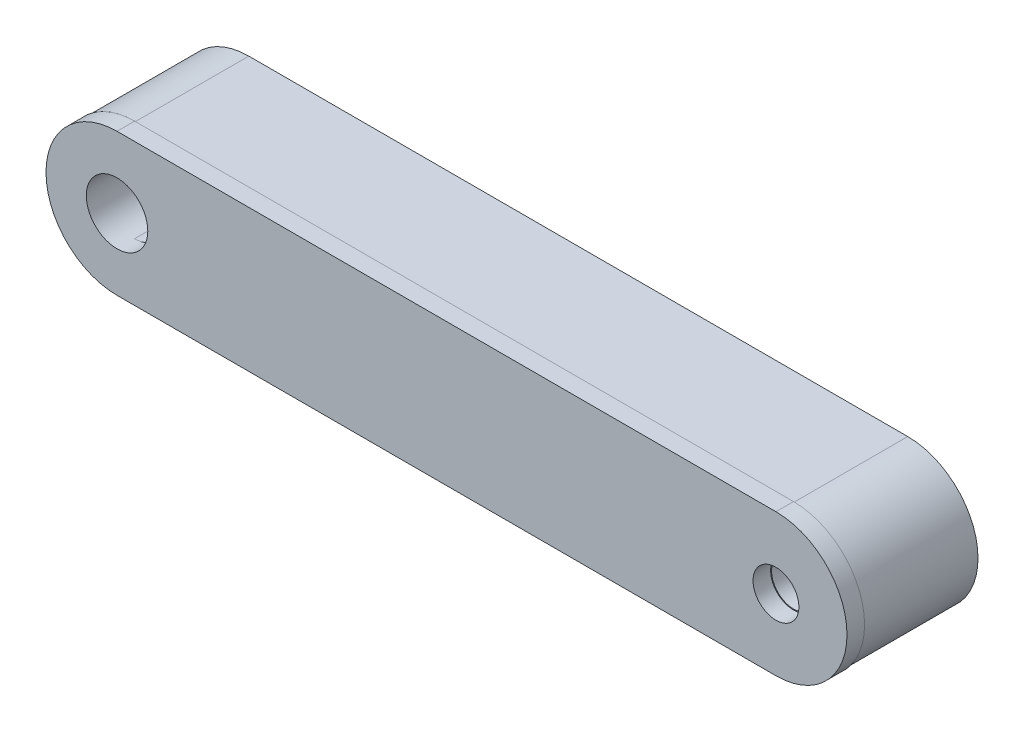
ISO-10303-21;
HEADER;
FILE_DESCRIPTION(('STEP AP214'),'2;1');
FILE_NAME('part.step','',(''),(''),'','','');
FILE_SCHEMA(('AUTOMOTIVE_DESIGN { 1 0 10303 214 1 1 1 1 }'));
ENDSEC;
DATA;
#1=APPLICATION_CONTEXT('core data for automotive mechanical design processes');
#2=APPLICATION_PROTOCOL_DEFINITION('international standard','automotive_design',2000,#1);
#3=PRODUCT_CONTEXT('',#1,'mechanical');
#4=PRODUCT('Part','Part','',(#3));
#5=PRODUCT_RELATED_PRODUCT_CATEGORY('part','',(#4));
#6=PRODUCT_DEFINITION_FORMATION('','',#4);
#7=PRODUCT_DEFINITION_CONTEXT('part definition',#1,'design');
#8=PRODUCT_DEFINITION('design','',#6,#7);
#9=PRODUCT_DEFINITION_SHAPE('','',#8);
#10=(LENGTH_UNIT() NAMED_UNIT(*) SI_UNIT(.MILLI.,.METRE.));
#11=(NAMED_UNIT(*) PLANE_ANGLE_UNIT() SI_UNIT($,.RADIAN.));
#12=(NAMED_UNIT(*) SI_UNIT($,.STERADIAN.) SOLID_ANGLE_UNIT());
#13=UNCERTAINTY_MEASURE_WITH_UNIT(LENGTH_MEASURE(1.E-05),#10,'distance_accuracy_value','');
#14=(GEOMETRIC_REPRESENTATION_CONTEXT(3) GLOBAL_UNCERTAINTY_ASSIGNED_CONTEXT((#13)) GLOBAL_UNIT_ASSIGNED_CONTEXT((#10,
#11,#12)) REPRESENTATION_CONTEXT('',''));
#15=CARTESIAN_POINT('',(0.,0.,0.));
#16=DIRECTION('',(0.,0.,1.));
#17=DIRECTION('',(1.,0.,0.));
#18=AXIS2_PLACEMENT_3D('',#15,#16,#17);
#19=CARTESIAN_POINT('',(-89.7682873370258,37.3359599747915,13.));
#20=DIRECTION('',(0.,0.,1.));
#21=DIRECTION('',(1.,0.,0.));
#22=AXIS2_PLACEMENT_3D('',#19,#20,#21);
#23=PLANE('',#22);
#24=CARTESIAN_POINT('',(-14.7682873370258,37.3359599747915,13.));
#25=DIRECTION('',(0.,0.,1.));
#26=DIRECTION('',(1.,0.,0.));
#27=AXIS2_PLACEMENT_3D('',#24,#25,#26);
#28=CIRCLE('',#27,2.5);
#29=CARTESIAN_POINT('',(-12.2682873370258,37.3359599747915,13.));
#30=VERTEX_POINT('',#29);
#31=EDGE_CURVE('E190',#30,#30,#28,.T.);
#32=ORIENTED_EDGE('',*,*,#31,.F.);
#33=EDGE_LOOP('',(#32));
#34=FACE_BOUND('',#33,.T.);
#35=CARTESIAN_POINT('',(-14.7682873370258,37.3359599747915,13.));
#36=DIRECTION('',(0.,0.,1.));
#37=DIRECTION('',(1.,0.,0.));
#38=AXIS2_PLACEMENT_3D('',#35,#36,#37);
#39=CIRCLE('',#38,2.60991752517465);
#40=CARTESIAN_POINT('',(-12.1583698118512,37.3359599747915,13.));
#41=VERTEX_POINT('',#40);
#42=EDGE_CURVE('E334',#41,#41,#39,.T.);
#43=ORIENTED_EDGE('',*,*,#42,.T.);
#44=EDGE_LOOP('',(#43));
#45=FACE_BOUND('',#44,.T.);
#46=ADVANCED_FACE('F34',(#34,#45),#23,.T.);
#47=CARTESIAN_POINT('',(-89.7682873370258,37.3359599747915,0.));
#48=DIRECTION('',(0.,0.,1.));
#49=DIRECTION('',(1.,0.,0.));
#50=AXIS2_PLACEMENT_3D('',#47,#48,#49);
#51=PLANE('',#50);
#52=CARTESIAN_POINT('',(-14.7682873370258,37.3359599747915,0.));
#53=DIRECTION('',(0.,0.,1.));
#54=DIRECTION('',(1.,0.,0.));
#55=AXIS2_PLACEMENT_3D('',#52,#53,#54);
#56=CIRCLE('',#55,2.5);
#57=CARTESIAN_POINT('',(-12.2682873370258,37.3359599747915,0.));
#58=VERTEX_POINT('',#57);
#59=EDGE_CURVE('E194',#58,#58,#56,.T.);
#60=ORIENTED_EDGE('',*,*,#59,.T.);
#61=EDGE_LOOP('',(#60));
#62=FACE_BOUND('',#61,.T.);
#63=CARTESIAN_POINT('',(-89.7682873370258,37.3359599747915,0.));
#64=DIRECTION('',(0.,0.,1.));
#65=DIRECTION('',(1.,0.,0.));
#66=AXIS2_PLACEMENT_3D('',#63,#64,#65);
#67=CIRCLE('',#66,7.99754796356378);
#68=CARTESIAN_POINT('',(-89.7682873370258,45.3335079383553,0.));
#69=VERTEX_POINT('',#68);
#70=CARTESIAN_POINT('',(-89.7682873370258,29.3384120112277,0.));
#71=VERTEX_POINT('',#70);
#72=EDGE_CURVE('E193',#69,#71,#67,.T.);
#73=ORIENTED_EDGE('',*,*,#72,.F.);
#74=DIRECTION('',(-1.,0.,0.));
#75=VECTOR('',#74,1.);
#76=CARTESIAN_POINT('',(-89.7682873370258,45.3335079383553,0.));
#77=LINE('',#76,#75);
#78=CARTESIAN_POINT('',(-14.7682873370258,45.3335079383553,0.));
#79=VERTEX_POINT('',#78);
#80=EDGE_CURVE('E201',#79,#69,#77,.T.);
#81=ORIENTED_EDGE('',*,*,#80,.F.);
#82=CARTESIAN_POINT('',(-14.7682873370258,37.3359599747915,0.));
#83=DIRECTION('',(0.,0.,1.));
#84=DIRECTION('',(1.,0.,0.));
#85=AXIS2_PLACEMENT_3D('',#82,#83,#84);
#86=CIRCLE('',#85,7.99754796356378);
#87=CARTESIAN_POINT('',(-14.7682873370258,29.3384120112278,0.));
#88=VERTEX_POINT('',#87);
#89=EDGE_CURVE('E215',#88,#79,#86,.T.);
#90=ORIENTED_EDGE('',*,*,#89,.F.);
#91=DIRECTION('',(1.,0.,0.));
#92=VECTOR('',#91,1.);
#93=CARTESIAN_POINT('',(-89.7682873370258,29.3384120112277,0.));
#94=LINE('',#93,#92);
#95=EDGE_CURVE('E213',#71,#88,#94,.T.);
#96=ORIENTED_EDGE('',*,*,#95,.F.);
#97=EDGE_LOOP('',(#73,#81,#90,#96));
#98=FACE_BOUND('',#97,.T.);
#99=CARTESIAN_POINT('',(-89.7682873370258,37.3359599747915,0.));
#100=DIRECTION('',(0.,0.,1.));
#101=DIRECTION('',(1.,0.,0.));
#102=AXIS2_PLACEMENT_3D('',#99,#100,#101);
#103=CIRCLE('',#102,3.50000000000001);
#104=CARTESIAN_POINT('',(-89.7682873370258,40.8359599747915,0.));
#105=VERTEX_POINT('',#104);
#106=CARTESIAN_POINT('',(-89.7682873370258,33.8359599747915,0.));
#107=VERTEX_POINT('',#106);
#108=EDGE_CURVE('E59',#105,#107,#103,.T.);
#109=ORIENTED_EDGE('',*,*,#108,.T.);
#110=DIRECTION('',(1.,0.,0.));
#111=VECTOR('',#110,1.);
#112=CARTESIAN_POINT('',(-89.7682873370258,33.8359599747915,0.));
#113=LINE('',#112,#111);
#114=CARTESIAN_POINT('',(-77.7682873370258,33.8359599747915,0.));
#115=VERTEX_POINT('',#114);
#116=EDGE_CURVE('E154',#107,#115,#113,.T.);
#117=ORIENTED_EDGE('',*,*,#116,.T.);
#118=CARTESIAN_POINT('',(-77.7682873370258,37.3359599747915,0.));
#119=DIRECTION('',(0.,0.,1.));
#120=DIRECTION('',(-1.,0.,0.));
#121=AXIS2_PLACEMENT_3D('',#118,#119,#120);
#122=CIRCLE('',#121,3.50000000000001);
#123=CARTESIAN_POINT('',(-77.7682873370258,40.8359599747915,0.));
#124=VERTEX_POINT('',#123);
#125=EDGE_CURVE('E237',#115,#124,#122,.T.);
#126=ORIENTED_EDGE('',*,*,#125,.T.);
#127=DIRECTION('',(-1.,0.,0.));
#128=VECTOR('',#127,1.);
#129=CARTESIAN_POINT('',(-89.7682873370258,40.8359599747915,0.));
#130=LINE('',#129,#128);
#131=EDGE_CURVE('E187',#124,#105,#130,.T.);
#132=ORIENTED_EDGE('',*,*,#131,.T.);
#133=EDGE_LOOP('',(#109,#117,#126,#132));
#134=FACE_BOUND('',#133,.T.);
#135=ADVANCED_FACE('F235',(#62,#98,#134),#51,.F.);
#136=CARTESIAN_POINT('',(-89.7682873370258,37.3359599747915,13.));
#137=DIRECTION('',(0.,0.,-1.));
#138=DIRECTION('',(-1.,0.,0.));
#139=AXIS2_PLACEMENT_3D('',#136,#137,#138);
#140=CYLINDRICAL_SURFACE('',#139,7.99754796356378);
#141=ORIENTED_EDGE('',*,*,#72,.T.);
#142=DIRECTION('',(0.,0.,-1.));
#143=VECTOR('',#142,1.);
#144=CARTESIAN_POINT('',(-89.7682873370258,29.3384120112277,13.));
#145=LINE('',#144,#143);
#146=CARTESIAN_POINT('',(-89.7682873370258,29.3384120112277,13.));
#147=VERTEX_POINT('',#146);
#148=EDGE_CURVE('E11',#147,#71,#145,.T.);
#149=ORIENTED_EDGE('',*,*,#148,.F.);
#150=CARTESIAN_POINT('',(-89.7682873370258,37.3359599747915,13.));
#151=DIRECTION('',(0.,0.,1.));
#152=DIRECTION('',(1.,0.,0.));
#153=AXIS2_PLACEMENT_3D('',#150,#151,#152);
#154=CIRCLE('',#153,7.99754796356378);
#155=CARTESIAN_POINT('',(-89.7682873370258,45.3335079383553,13.));
#156=VERTEX_POINT('',#155);
#157=EDGE_CURVE('E197',#156,#147,#154,.T.);
#158=ORIENTED_EDGE('',*,*,#157,.F.);
#159=DIRECTION('',(0.,0.,-1.));
#160=VECTOR('',#159,1.);
#161=CARTESIAN_POINT('',(-89.7682873370258,45.3335079383553,13.));
#162=LINE('',#161,#160);
#163=EDGE_CURVE('E210',#156,#69,#162,.T.);
#164=ORIENTED_EDGE('',*,*,#163,.T.);
#165=EDGE_LOOP('',(#141,#149,#158,#164));
#166=FACE_BOUND('',#165,.T.);
#167=ADVANCED_FACE('F36',(#166),#140,.T.);
#168=CARTESIAN_POINT('',(-89.7682873370258,29.3384120112277,13.));
#169=DIRECTION('',(0.,1.,0.));
#170=DIRECTION('',(0.,0.,1.));
#171=AXIS2_PLACEMENT_3D('',#168,#169,#170);
#172=PLANE('',#171);
#173=ORIENTED_EDGE('',*,*,#95,.T.);
#174=DIRECTION('',(0.,0.,-1.));
#175=VECTOR('',#174,1.);
#176=CARTESIAN_POINT('',(-14.7682873370258,29.3384120112278,13.));
#177=LINE('',#176,#175);
#178=CARTESIAN_POINT('',(-14.7682873370258,29.3384120112278,13.));
#179=VERTEX_POINT('',#178);
#180=EDGE_CURVE('E43',#179,#88,#177,.T.);
#181=ORIENTED_EDGE('',*,*,#180,.F.);
#182=DIRECTION('',(1.,0.,0.));
#183=VECTOR('',#182,1.);
#184=CARTESIAN_POINT('',(-89.7682873370258,29.3384120112277,13.));
#185=LINE('',#184,#183);
#186=EDGE_CURVE('E200',#147,#179,#185,.T.);
#187=ORIENTED_EDGE('',*,*,#186,.F.);
#188=ORIENTED_EDGE('',*,*,#148,.T.);
#189=EDGE_LOOP('',(#173,#181,#187,#188));
#190=FACE_BOUND('',#189,.T.);
#191=ADVANCED_FACE('F270',(#190),#172,.F.);
#192=CARTESIAN_POINT('',(-14.7682873370258,37.3359599747915,13.));
#193=DIRECTION('',(0.,0.,-1.));
#194=DIRECTION('',(-1.,0.,0.));
#195=AXIS2_PLACEMENT_3D('',#192,#193,#194);
#196=CYLINDRICAL_SURFACE('',#195,7.99754796356378);
#197=ORIENTED_EDGE('',*,*,#89,.T.);
#198=DIRECTION('',(0.,0.,-1.));
#199=VECTOR('',#198,1.);
#200=CARTESIAN_POINT('',(-14.7682873370258,45.3335079383553,13.));
#201=LINE('',#200,#199);
#202=CARTESIAN_POINT('',(-14.7682873370258,45.3335079383553,13.));
#203=VERTEX_POINT('',#202);
#204=EDGE_CURVE('E220',#203,#79,#201,.T.);
#205=ORIENTED_EDGE('',*,*,#204,.F.);
#206=CARTESIAN_POINT('',(-14.7682873370258,37.3359599747915,13.));
#207=DIRECTION('',(0.,0.,1.));
#208=DIRECTION('',(1.,0.,0.));
#209=AXIS2_PLACEMENT_3D('',#206,#207,#208);
#210=CIRCLE('',#209,7.99754796356378);
#211=EDGE_CURVE('E204',#179,#203,#210,.T.);
#212=ORIENTED_EDGE('',*,*,#211,.F.);
#213=ORIENTED_EDGE('',*,*,#180,.T.);
#214=EDGE_LOOP('',(#197,#205,#212,#213));
#215=FACE_BOUND('',#214,.T.);
#216=ADVANCED_FACE('F267',(#215),#196,.T.);
#217=CARTESIAN_POINT('',(-89.7682873370258,45.3335079383553,13.));
#218=DIRECTION('',(0.,-1.,0.));
#219=DIRECTION('',(0.,0.,-1.));
#220=AXIS2_PLACEMENT_3D('',#217,#218,#219);
#221=PLANE('',#220);
#222=ORIENTED_EDGE('',*,*,#80,.T.);
#223=ORIENTED_EDGE('',*,*,#163,.F.);
#224=DIRECTION('',(-1.,0.,0.));
#225=VECTOR('',#224,1.);
#226=CARTESIAN_POINT('',(-89.7682873370258,45.3335079383553,13.));
#227=LINE('',#226,#225);
#228=EDGE_CURVE('E207',#203,#156,#227,.T.);
#229=ORIENTED_EDGE('',*,*,#228,.F.);
#230=ORIENTED_EDGE('',*,*,#204,.T.);
#231=EDGE_LOOP('',(#222,#223,#229,#230));
#232=FACE_BOUND('',#231,.T.);
#233=ADVANCED_FACE('F264',(#232),#221,.F.);
#234=CARTESIAN_POINT('',(-14.7682873370258,37.3359599747915,13.));
#235=DIRECTION('',(0.,0.,-1.));
#236=DIRECTION('',(-1.,0.,0.));
#237=AXIS2_PLACEMENT_3D('',#234,#235,#236);
#238=CYLINDRICAL_SURFACE('',#237,2.5);
#239=ORIENTED_EDGE('',*,*,#31,.T.);
#240=EDGE_LOOP('',(#239));
#241=FACE_BOUND('',#240,.T.);
#242=ORIENTED_EDGE('',*,*,#59,.F.);
#243=EDGE_LOOP('',(#242));
#244=FACE_BOUND('',#243,.T.);
#245=ADVANCED_FACE('F250',(#241,#244),#238,.F.);
#246=CARTESIAN_POINT('',(-89.7682873370258,37.3359599747915,13.));
#247=DIRECTION('',(0.,0.,-1.));
#248=DIRECTION('',(-1.,0.,0.));
#249=AXIS2_PLACEMENT_3D('',#246,#247,#248);
#250=CYLINDRICAL_SURFACE('',#249,3.50000000000001);
#251=ORIENTED_EDGE('',*,*,#108,.F.);
#252=DIRECTION('',(0.,0.,-1.));
#253=VECTOR('',#252,1.);
#254=CARTESIAN_POINT('',(-89.7682873370258,40.8359599747915,13.));
#255=LINE('',#254,#253);
#256=CARTESIAN_POINT('',(-89.7682873370258,40.8359599747915,13.));
#257=VERTEX_POINT('',#256);
#258=EDGE_CURVE('E173',#257,#105,#255,.T.);
#259=ORIENTED_EDGE('',*,*,#258,.F.);
#260=CARTESIAN_POINT('',(-89.7682873370258,37.3359599747915,13.));
#261=DIRECTION('',(0.,0.,1.));
#262=DIRECTION('',(1.,0.,0.));
#263=AXIS2_PLACEMENT_3D('',#260,#261,#262);
#264=CIRCLE('',#263,3.50000000000001);
#265=CARTESIAN_POINT('',(-89.7682873370258,33.8359599747915,13.));
#266=VERTEX_POINT('',#265);
#267=EDGE_CURVE('E162',#266,#257,#264,.T.);
#268=ORIENTED_EDGE('',*,*,#267,.F.);
#269=DIRECTION('',(0.,0.,-1.));
#270=VECTOR('',#269,1.);
#271=CARTESIAN_POINT('',(-89.7682873370258,33.8359599747915,13.));
#272=LINE('',#271,#270);
#273=EDGE_CURVE('E184',#266,#107,#272,.T.);
#274=ORIENTED_EDGE('',*,*,#273,.T.);
#275=EDGE_LOOP('',(#251,#259,#268,#274));
#276=FACE_BOUND('',#275,.T.);
#277=CARTESIAN_POINT('',(-89.7682873370258,37.3359599747915,15.));
#278=DIRECTION('',(0.,0.,1.));
#279=DIRECTION('',(1.,0.,0.));
#280=AXIS2_PLACEMENT_3D('',#277,#278,#279);
#281=CIRCLE('',#280,3.50000000000001);
#282=CARTESIAN_POINT('',(-86.2682873370258,37.3359599747915,15.));
#283=VERTEX_POINT('',#282);
#284=EDGE_CURVE('E164',#283,#283,#281,.T.);
#285=ORIENTED_EDGE('',*,*,#284,.T.);
#286=EDGE_LOOP('',(#285));
#287=FACE_BOUND('',#286,.T.);
#288=ADVANCED_FACE('F230',(#276,#287),#250,.F.);
#289=CARTESIAN_POINT('',(-89.7682873370258,33.8359599747915,13.));
#290=DIRECTION('',(0.,1.,0.));
#291=DIRECTION('',(0.,0.,1.));
#292=AXIS2_PLACEMENT_3D('',#289,#290,#291);
#293=PLANE('',#292);
#294=ORIENTED_EDGE('',*,*,#116,.F.);
#295=ORIENTED_EDGE('',*,*,#273,.F.);
#296=DIRECTION('',(1.,0.,0.));
#297=VECTOR('',#296,1.);
#298=CARTESIAN_POINT('',(-89.7682873370258,33.8359599747915,13.));
#299=LINE('',#298,#297);
#300=CARTESIAN_POINT('',(-77.7682873370258,33.8359599747915,13.));
#301=VERTEX_POINT('',#300);
#302=EDGE_CURVE('E168',#266,#301,#299,.T.);
#303=ORIENTED_EDGE('',*,*,#302,.T.);
#304=DIRECTION('',(0.,0.,-1.));
#305=VECTOR('',#304,1.);
#306=CARTESIAN_POINT('',(-77.7682873370258,33.8359599747915,13.));
#307=LINE('',#306,#305);
#308=EDGE_CURVE('E180',#301,#115,#307,.T.);
#309=ORIENTED_EDGE('',*,*,#308,.T.);
#310=EDGE_LOOP('',(#294,#295,#303,#309));
#311=FACE_BOUND('',#310,.T.);
#312=ADVANCED_FACE('F242',(#311),#293,.T.);
#313=CARTESIAN_POINT('',(-77.7682873370258,37.3359599747915,13.));
#314=DIRECTION('',(0.,0.,-1.));
#315=DIRECTION('',(-1.,0.,0.));
#316=AXIS2_PLACEMENT_3D('',#313,#314,#315);
#317=CYLINDRICAL_SURFACE('',#316,3.50000000000001);
#318=ORIENTED_EDGE('',*,*,#125,.F.);
#319=ORIENTED_EDGE('',*,*,#308,.F.);
#320=CARTESIAN_POINT('',(-77.7682873370258,37.3359599747915,13.));
#321=DIRECTION('',(0.,0.,1.));
#322=DIRECTION('',(-1.,0.,0.));
#323=AXIS2_PLACEMENT_3D('',#320,#321,#322);
#324=CIRCLE('',#323,3.50000000000001);
#325=CARTESIAN_POINT('',(-77.7682873370258,40.8359599747915,13.));
#326=VERTEX_POINT('',#325);
#327=EDGE_CURVE('E165',#301,#326,#324,.T.);
#328=ORIENTED_EDGE('',*,*,#327,.T.);
#329=DIRECTION('',(0.,0.,-1.));
#330=VECTOR('',#329,1.);
#331=CARTESIAN_POINT('',(-77.7682873370258,40.8359599747915,13.));
#332=LINE('',#331,#330);
#333=EDGE_CURVE('E176',#326,#124,#332,.T.);
#334=ORIENTED_EDGE('',*,*,#333,.T.);
#335=EDGE_LOOP('',(#318,#319,#328,#334));
#336=FACE_BOUND('',#335,.T.);
#337=ADVANCED_FACE('F240',(#336),#317,.F.);
#338=CARTESIAN_POINT('',(-89.7682873370258,40.8359599747915,13.));
#339=DIRECTION('',(0.,-1.,0.));
#340=DIRECTION('',(0.,0.,-1.));
#341=AXIS2_PLACEMENT_3D('',#338,#339,#340);
#342=PLANE('',#341);
#343=ORIENTED_EDGE('',*,*,#131,.F.);
#344=ORIENTED_EDGE('',*,*,#333,.F.);
#345=DIRECTION('',(-1.,0.,0.));
#346=VECTOR('',#345,1.);
#347=CARTESIAN_POINT('',(-89.7682873370258,40.8359599747915,13.));
#348=LINE('',#347,#346);
#349=EDGE_CURVE('E51',#326,#257,#348,.T.);
#350=ORIENTED_EDGE('',*,*,#349,.T.);
#351=ORIENTED_EDGE('',*,*,#258,.T.);
#352=EDGE_LOOP('',(#343,#344,#350,#351));
#353=FACE_BOUND('',#352,.T.);
#354=ADVANCED_FACE('F238',(#353),#342,.T.);
#355=CARTESIAN_POINT('',(-89.7682873370258,37.3359599747915,13.));
#356=DIRECTION('',(0.,0.,1.));
#357=DIRECTION('',(1.,0.,0.));
#358=AXIS2_PLACEMENT_3D('',#355,#356,#357);
#359=PLANE('',#358);
#360=CARTESIAN_POINT('',(-89.7682873370258,37.3359599747915,13.));
#361=DIRECTION('',(0.,0.,1.));
#362=DIRECTION('',(1.,0.,0.));
#363=AXIS2_PLACEMENT_3D('',#360,#361,#362);
#364=CIRCLE('',#363,8.08632453575369);
#365=CARTESIAN_POINT('',(-89.7682873370258,45.4222845105452,13.));
#366=VERTEX_POINT('',#365);
#367=CARTESIAN_POINT('',(-89.7682873370258,29.2496354390378,13.));
#368=VERTEX_POINT('',#367);
#369=EDGE_CURVE('E152',#366,#368,#364,.T.);
#370=ORIENTED_EDGE('',*,*,#369,.F.);
#371=DIRECTION('',(-1.,0.,0.));
#372=VECTOR('',#371,1.);
#373=CARTESIAN_POINT('',(-89.7682873370258,45.4222845105452,13.));
#374=LINE('',#373,#372);
#375=CARTESIAN_POINT('',(-14.7682873370258,45.4222845105452,13.));
#376=VERTEX_POINT('',#375);
#377=EDGE_CURVE('E148',#376,#366,#374,.T.);
#378=ORIENTED_EDGE('',*,*,#377,.F.);
#379=CARTESIAN_POINT('',(-14.7682873370258,37.3359599747915,13.));
#380=DIRECTION('',(0.,0.,1.));
#381=DIRECTION('',(1.,0.,0.));
#382=AXIS2_PLACEMENT_3D('',#379,#380,#381);
#383=CIRCLE('',#382,8.08632453575369);
#384=CARTESIAN_POINT('',(-14.7682873370258,29.2496354390378,13.));
#385=VERTEX_POINT('',#384);
#386=EDGE_CURVE('E326',#385,#376,#383,.T.);
#387=ORIENTED_EDGE('',*,*,#386,.F.);
#388=DIRECTION('',(1.,0.,0.));
#389=VECTOR('',#388,1.);
#390=CARTESIAN_POINT('',(-89.7682873370258,29.2496354390378,13.));
#391=LINE('',#390,#389);
#392=EDGE_CURVE('E329',#368,#385,#391,.T.);
#393=ORIENTED_EDGE('',*,*,#392,.F.);
#394=EDGE_LOOP('',(#370,#378,#387,#393));
#395=FACE_BOUND('',#394,.T.);
#396=ORIENTED_EDGE('',*,*,#228,.T.);
#397=ORIENTED_EDGE('',*,*,#157,.T.);
#398=ORIENTED_EDGE('',*,*,#186,.T.);
#399=ORIENTED_EDGE('',*,*,#211,.T.);
#400=EDGE_LOOP('',(#396,#397,#398,#399));
#401=FACE_BOUND('',#400,.T.);
#402=ADVANCED_FACE('F287',(#395,#401),#359,.F.);
#403=CARTESIAN_POINT('',(-89.7682873370258,37.3359599747915,15.));
#404=DIRECTION('',(0.,0.,1.));
#405=DIRECTION('',(1.,0.,0.));
#406=AXIS2_PLACEMENT_3D('',#403,#404,#405);
#407=PLANE('',#406);
#408=CARTESIAN_POINT('',(-14.7682873370258,37.3359599747915,15.));
#409=DIRECTION('',(0.,0.,1.));
#410=DIRECTION('',(1.,0.,0.));
#411=AXIS2_PLACEMENT_3D('',#408,#409,#410);
#412=CIRCLE('',#411,2.60991752517465);
#413=CARTESIAN_POINT('',(-12.1583698118512,37.3359599747915,15.));
#414=VERTEX_POINT('',#413);
#415=EDGE_CURVE('E330',#414,#414,#412,.T.);
#416=ORIENTED_EDGE('',*,*,#415,.F.);
#417=EDGE_LOOP('',(#416));
#418=FACE_BOUND('',#417,.T.);
#419=CARTESIAN_POINT('',(-89.7682873370258,37.3359599747915,15.));
#420=DIRECTION('',(0.,0.,1.));
#421=DIRECTION('',(1.,0.,0.));
#422=AXIS2_PLACEMENT_3D('',#419,#420,#421);
#423=CIRCLE('',#422,8.08632453575369);
#424=CARTESIAN_POINT('',(-89.7682873370258,45.4222845105452,15.));
#425=VERTEX_POINT('',#424);
#426=CARTESIAN_POINT('',(-89.7682873370258,29.2496354390378,15.));
#427=VERTEX_POINT('',#426);
#428=EDGE_CURVE('E138',#425,#427,#423,.T.);
#429=ORIENTED_EDGE('',*,*,#428,.T.);
#430=DIRECTION('',(1.,0.,0.));
#431=VECTOR('',#430,1.);
#432=CARTESIAN_POINT('',(-89.7682873370258,29.2496354390378,15.));
#433=LINE('',#432,#431);
#434=CARTESIAN_POINT('',(-14.7682873370258,29.2496354390378,15.));
#435=VERTEX_POINT('',#434);
#436=EDGE_CURVE('E127',#427,#435,#433,.T.);
#437=ORIENTED_EDGE('',*,*,#436,.T.);
#438=CARTESIAN_POINT('',(-14.7682873370258,37.3359599747915,15.));
#439=DIRECTION('',(0.,0.,1.));
#440=DIRECTION('',(1.,0.,0.));
#441=AXIS2_PLACEMENT_3D('',#438,#439,#440);
#442=CIRCLE('',#441,8.08632453575369);
#443=CARTESIAN_POINT('',(-14.7682873370258,45.4222845105452,15.));
#444=VERTEX_POINT('',#443);
#445=EDGE_CURVE('E137',#435,#444,#442,.T.);
#446=ORIENTED_EDGE('',*,*,#445,.T.);
#447=DIRECTION('',(-1.,0.,0.));
#448=VECTOR('',#447,1.);
#449=CARTESIAN_POINT('',(-89.7682873370258,45.4222845105452,15.));
#450=LINE('',#449,#448);
#451=EDGE_CURVE('E144',#444,#425,#450,.T.);
#452=ORIENTED_EDGE('',*,*,#451,.T.);
#453=EDGE_LOOP('',(#429,#437,#446,#452));
#454=FACE_BOUND('',#453,.T.);
#455=ORIENTED_EDGE('',*,*,#284,.F.);
#456=EDGE_LOOP('',(#455));
#457=FACE_BOUND('',#456,.T.);
#458=ADVANCED_FACE('F141',(#418,#454,#457),#407,.T.);
#459=ORIENTED_EDGE('',*,*,#302,.F.);
#460=ORIENTED_EDGE('',*,*,#267,.T.);
#461=ORIENTED_EDGE('',*,*,#349,.F.);
#462=ORIENTED_EDGE('',*,*,#327,.F.);
#463=EDGE_LOOP('',(#459,#460,#461,#462));
#464=FACE_BOUND('',#463,.T.);
#465=ADVANCED_FACE('F241',(#464),#359,.F.);
#466=CARTESIAN_POINT('',(-89.7682873370258,37.3359599747915,15.));
#467=DIRECTION('',(0.,0.,-1.));
#468=DIRECTION('',(-1.,0.,0.));
#469=AXIS2_PLACEMENT_3D('',#466,#467,#468);
#470=CYLINDRICAL_SURFACE('',#469,8.08632453575369);
#471=ORIENTED_EDGE('',*,*,#369,.T.);
#472=DIRECTION('',(0.,0.,-1.));
#473=VECTOR('',#472,1.);
#474=CARTESIAN_POINT('',(-89.7682873370258,29.2496354390378,15.));
#475=LINE('',#474,#473);
#476=EDGE_CURVE('E131',#427,#368,#475,.T.);
#477=ORIENTED_EDGE('',*,*,#476,.F.);
#478=ORIENTED_EDGE('',*,*,#428,.F.);
#479=DIRECTION('',(0.,0.,-1.));
#480=VECTOR('',#479,1.);
#481=CARTESIAN_POINT('',(-89.7682873370258,45.4222845105452,15.));
#482=LINE('',#481,#480);
#483=EDGE_CURVE('E323',#425,#366,#482,.T.);
#484=ORIENTED_EDGE('',*,*,#483,.T.);
#485=EDGE_LOOP('',(#471,#477,#478,#484));
#486=FACE_BOUND('',#485,.T.);
#487=ADVANCED_FACE('F150',(#486),#470,.T.);
#488=CARTESIAN_POINT('',(-89.7682873370258,29.2496354390378,15.));
#489=DIRECTION('',(0.,1.,0.));
#490=DIRECTION('',(0.,0.,1.));
#491=AXIS2_PLACEMENT_3D('',#488,#489,#490);
#492=PLANE('',#491);
#493=ORIENTED_EDGE('',*,*,#392,.T.);
#494=DIRECTION('',(0.,0.,-1.));
#495=VECTOR('',#494,1.);
#496=CARTESIAN_POINT('',(-14.7682873370258,29.2496354390378,15.));
#497=LINE('',#496,#495);
#498=EDGE_CURVE('E134',#435,#385,#497,.T.);
#499=ORIENTED_EDGE('',*,*,#498,.F.);
#500=ORIENTED_EDGE('',*,*,#436,.F.);
#501=ORIENTED_EDGE('',*,*,#476,.T.);
#502=EDGE_LOOP('',(#493,#499,#500,#501));
#503=FACE_BOUND('',#502,.T.);
#504=ADVANCED_FACE('F129',(#503),#492,.F.);
#505=CARTESIAN_POINT('',(-14.7682873370258,37.3359599747915,15.));
#506=DIRECTION('',(0.,0.,-1.));
#507=DIRECTION('',(-1.,0.,0.));
#508=AXIS2_PLACEMENT_3D('',#505,#506,#507);
#509=CYLINDRICAL_SURFACE('',#508,8.08632453575369);
#510=ORIENTED_EDGE('',*,*,#386,.T.);
#511=DIRECTION('',(0.,0.,-1.));
#512=VECTOR('',#511,1.);
#513=CARTESIAN_POINT('',(-14.7682873370258,45.4222845105452,15.));
#514=LINE('',#513,#512);
#515=EDGE_CURVE('E156',#444,#376,#514,.T.);
#516=ORIENTED_EDGE('',*,*,#515,.F.);
#517=ORIENTED_EDGE('',*,*,#445,.F.);
#518=ORIENTED_EDGE('',*,*,#498,.T.);
#519=EDGE_LOOP('',(#510,#516,#517,#518));
#520=FACE_BOUND('',#519,.T.);
#521=ADVANCED_FACE('F307',(#520),#509,.T.);
#522=CARTESIAN_POINT('',(-89.7682873370258,45.4222845105452,15.));
#523=DIRECTION('',(0.,-1.,0.));
#524=DIRECTION('',(0.,0.,-1.));
#525=AXIS2_PLACEMENT_3D('',#522,#523,#524);
#526=PLANE('',#525);
#527=ORIENTED_EDGE('',*,*,#377,.T.);
#528=ORIENTED_EDGE('',*,*,#483,.F.);
#529=ORIENTED_EDGE('',*,*,#451,.F.);
#530=ORIENTED_EDGE('',*,*,#515,.T.);
#531=EDGE_LOOP('',(#527,#528,#529,#530));
#532=FACE_BOUND('',#531,.T.);
#533=ADVANCED_FACE('F311',(#532),#526,.F.);
#534=CARTESIAN_POINT('',(-14.7682873370258,37.3359599747915,15.));
#535=DIRECTION('',(0.,0.,-1.));
#536=DIRECTION('',(-1.,0.,0.));
#537=AXIS2_PLACEMENT_3D('',#534,#535,#536);
#538=CYLINDRICAL_SURFACE('',#537,2.60991752517465);
#539=ORIENTED_EDGE('',*,*,#415,.T.);
#540=EDGE_LOOP('',(#539));
#541=FACE_BOUND('',#540,.T.);
#542=ORIENTED_EDGE('',*,*,#42,.F.);
#543=EDGE_LOOP('',(#542));
#544=FACE_BOUND('',#543,.T.);
#545=ADVANCED_FACE('F314',(#541,#544),#538,.F.);
#546=CLOSED_SHELL('',(#46,#135,#167,#191,#216,#233,#245,#288,#312,#337,#354,#402,#458,#465,#487,
#504,#521,#533,#545));
#547=MANIFOLD_SOLID_BREP('B2',#546);
#548=ADVANCED_BREP_SHAPE_REPRESENTATION('',(#18,#547),#14);
#549=SHAPE_DEFINITION_REPRESENTATION(#9,#548);
ENDSEC;
END-ISO-10303-21;
